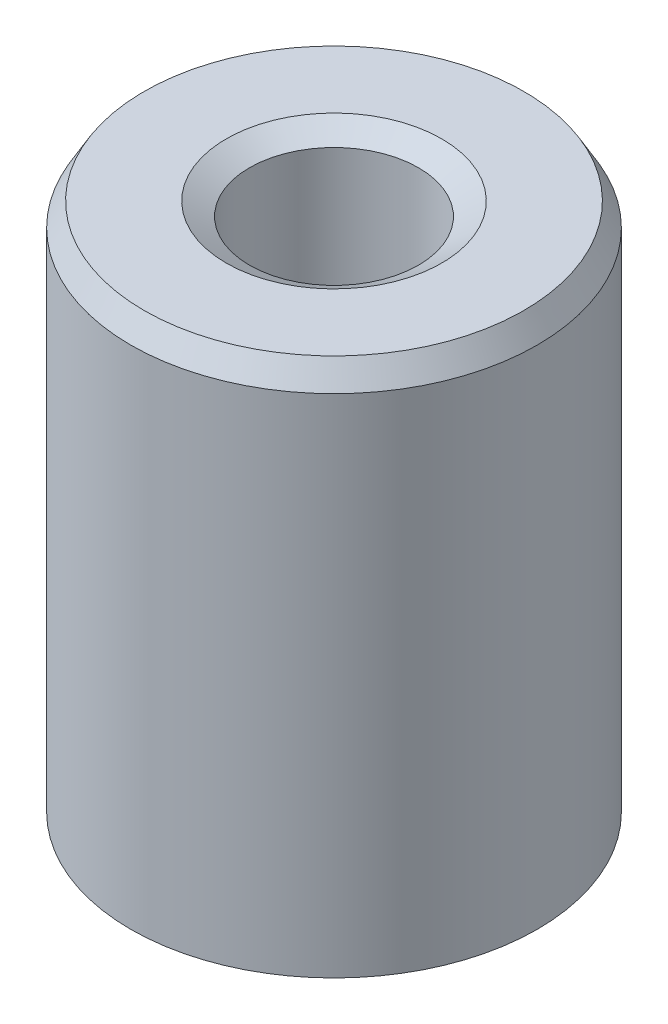
ISO-10303-21;
HEADER;
FILE_DESCRIPTION(('STEP AP214'),'2;1');
FILE_NAME('part.step','',(''),(''),'','','');
FILE_SCHEMA(('AUTOMOTIVE_DESIGN { 1 0 10303 214 1 1 1 1 }'));
ENDSEC;
DATA;
#1=APPLICATION_CONTEXT('core data for automotive mechanical design processes');
#2=APPLICATION_PROTOCOL_DEFINITION('international standard','automotive_design',2000,#1);
#3=PRODUCT_CONTEXT('',#1,'mechanical');
#4=PRODUCT('Part','Part','',(#3));
#5=PRODUCT_RELATED_PRODUCT_CATEGORY('part','',(#4));
#6=PRODUCT_DEFINITION_FORMATION('','',#4);
#7=PRODUCT_DEFINITION_CONTEXT('part definition',#1,'design');
#8=PRODUCT_DEFINITION('design','',#6,#7);
#9=PRODUCT_DEFINITION_SHAPE('','',#8);
#10=(LENGTH_UNIT() NAMED_UNIT(*) SI_UNIT(.MILLI.,.METRE.));
#11=(NAMED_UNIT(*) PLANE_ANGLE_UNIT() SI_UNIT($,.RADIAN.));
#12=(NAMED_UNIT(*) SI_UNIT($,.STERADIAN.) SOLID_ANGLE_UNIT());
#13=UNCERTAINTY_MEASURE_WITH_UNIT(LENGTH_MEASURE(1.E-05),#10,'distance_accuracy_value','');
#14=(GEOMETRIC_REPRESENTATION_CONTEXT(3) GLOBAL_UNCERTAINTY_ASSIGNED_CONTEXT((#13)) GLOBAL_UNIT_ASSIGNED_CONTEXT((#10,
#11,#12)) REPRESENTATION_CONTEXT('',''));
#15=CARTESIAN_POINT('',(0.,0.,0.));
#16=DIRECTION('',(0.,0.,1.));
#17=DIRECTION('',(1.,0.,0.));
#18=AXIS2_PLACEMENT_3D('',#15,#16,#17);
#19=CARTESIAN_POINT('',(0.,13.3513712068898,0.));
#20=DIRECTION('',(0.,-1.,0.));
#21=DIRECTION('',(0.,0.,-1.));
#22=AXIS2_PLACEMENT_3D('',#19,#20,#21);
#23=CYLINDRICAL_SURFACE('',#22,5.);
#24=CARTESIAN_POINT('',(0.,0.329792397933078,0.));
#25=DIRECTION('',(0.,1.,0.));
#26=DIRECTION('',(0.,0.,1.));
#27=AXIS2_PLACEMENT_3D('',#24,#25,#26);
#28=CIRCLE('',#27,5.);
#29=CARTESIAN_POINT('',(0.,0.329792397933078,5.));
#30=VERTEX_POINT('',#29);
#31=EDGE_CURVE('E10',#30,#30,#28,.T.);
#32=ORIENTED_EDGE('',*,*,#31,.T.);
#33=EDGE_LOOP('',(#32));
#34=FACE_BOUND('',#33,.T.);
#35=CARTESIAN_POINT('',(0.,12.7801540177198,0.));
#36=DIRECTION('',(0.,1.,0.));
#37=DIRECTION('',(0.,0.,1.));
#38=AXIS2_PLACEMENT_3D('',#35,#36,#37);
#39=CIRCLE('',#38,5.);
#40=CARTESIAN_POINT('',(0.,12.7801540177198,5.));
#41=VERTEX_POINT('',#40);
#42=EDGE_CURVE('E50',#41,#41,#39,.F.);
#43=ORIENTED_EDGE('',*,*,#42,.T.);
#44=EDGE_LOOP('',(#43));
#45=FACE_BOUND('',#44,.T.);
#46=ADVANCED_FACE('F39',(#34,#45),#23,.T.);
#47=CARTESIAN_POINT('',(0.,13.3513712068898,0.));
#48=DIRECTION('',(0.,1.,0.));
#49=DIRECTION('',(0.,0.,1.));
#50=AXIS2_PLACEMENT_3D('',#47,#48,#49);
#51=PLANE('',#50);
#52=CARTESIAN_POINT('',(0.,13.3513712068898,0.));
#53=DIRECTION('',(0.,1.,0.));
#54=DIRECTION('',(0.,0.,1.));
#55=AXIS2_PLACEMENT_3D('',#52,#53,#54);
#56=CIRCLE('',#55,2.65011560391063);
#57=CARTESIAN_POINT('',(0.,13.3513712068898,2.65011560391063));
#58=VERTEX_POINT('',#57);
#59=EDGE_CURVE('E58',#58,#58,#56,.F.);
#60=ORIENTED_EDGE('',*,*,#59,.T.);
#61=EDGE_LOOP('',(#60));
#62=FACE_BOUND('',#61,.T.);
#63=CARTESIAN_POINT('',(0.,13.3513712068898,0.));
#64=DIRECTION('',(0.,1.,0.));
#65=DIRECTION('',(0.,0.,1.));
#66=AXIS2_PLACEMENT_3D('',#63,#64,#65);
#67=CIRCLE('',#66,4.67020760206692);
#68=CARTESIAN_POINT('',(0.,13.3513712068898,4.67020760206692));
#69=VERTEX_POINT('',#68);
#70=EDGE_CURVE('E61',#69,#69,#67,.T.);
#71=ORIENTED_EDGE('',*,*,#70,.T.);
#72=EDGE_LOOP('',(#71));
#73=FACE_BOUND('',#72,.T.);
#74=ADVANCED_FACE('F88',(#62,#73),#51,.T.);
#75=CARTESIAN_POINT('',(0.,0.,0.));
#76=DIRECTION('',(0.,1.,0.));
#77=DIRECTION('',(0.,0.,1.));
#78=AXIS2_PLACEMENT_3D('',#75,#76,#77);
#79=PLANE('',#78);
#80=CARTESIAN_POINT('',(0.,0.,0.));
#81=DIRECTION('',(0.,1.,0.));
#82=DIRECTION('',(0.,0.,1.));
#83=AXIS2_PLACEMENT_3D('',#80,#81,#82);
#84=CIRCLE('',#83,2.40869081267364);
#85=CARTESIAN_POINT('',(0.,0.,2.40869081267364));
#86=VERTEX_POINT('',#85);
#87=EDGE_CURVE('E51',#86,#86,#84,.T.);
#88=ORIENTED_EDGE('',*,*,#87,.T.);
#89=EDGE_LOOP('',(#88));
#90=FACE_BOUND('',#89,.T.);
#91=CARTESIAN_POINT('',(0.,0.,0.));
#92=DIRECTION('',(0.,1.,0.));
#93=DIRECTION('',(0.,0.,1.));
#94=AXIS2_PLACEMENT_3D('',#91,#92,#93);
#95=CIRCLE('',#94,4.42878281082993);
#96=CARTESIAN_POINT('',(0.,0.,4.42878281082993));
#97=VERTEX_POINT('',#96);
#98=EDGE_CURVE('E54',#97,#97,#95,.F.);
#99=ORIENTED_EDGE('',*,*,#98,.T.);
#100=EDGE_LOOP('',(#99));
#101=FACE_BOUND('',#100,.T.);
#102=ADVANCED_FACE('F83',(#90,#101),#79,.F.);
#103=CARTESIAN_POINT('',(0.,13.3513712068898,0.));
#104=DIRECTION('',(0.,-1.,0.));
#105=DIRECTION('',(0.,0.,-1.));
#106=AXIS2_PLACEMENT_3D('',#103,#104,#105);
#107=CYLINDRICAL_SURFACE('',#106,2.07889841474056);
#108=CARTESIAN_POINT('',(0.,13.0215788089568,0.));
#109=DIRECTION('',(0.,1.,0.));
#110=DIRECTION('',(0.,0.,1.));
#111=AXIS2_PLACEMENT_3D('',#108,#109,#110);
#112=CIRCLE('',#111,2.07889841474056);
#113=CARTESIAN_POINT('',(0.,13.0215788089568,2.07889841474056));
#114=VERTEX_POINT('',#113);
#115=EDGE_CURVE('E67',#114,#114,#112,.T.);
#116=ORIENTED_EDGE('',*,*,#115,.T.);
#117=EDGE_LOOP('',(#116));
#118=FACE_BOUND('',#117,.T.);
#119=CARTESIAN_POINT('',(0.,0.571217189170073,0.));
#120=DIRECTION('',(0.,1.,0.));
#121=DIRECTION('',(0.,0.,1.));
#122=AXIS2_PLACEMENT_3D('',#119,#120,#121);
#123=CIRCLE('',#122,2.07889841474056);
#124=CARTESIAN_POINT('',(0.,0.571217189170073,2.07889841474056));
#125=VERTEX_POINT('',#124);
#126=EDGE_CURVE('E69',#125,#125,#123,.F.);
#127=ORIENTED_EDGE('',*,*,#126,.T.);
#128=EDGE_LOOP('',(#127));
#129=FACE_BOUND('',#128,.T.);
#130=ADVANCED_FACE('F71',(#118,#129),#107,.F.);
#131=CARTESIAN_POINT('',(0.,13.0215788089568,0.));
#132=DIRECTION('',(0.,1.,0.));
#133=DIRECTION('',(0.,0.,1.));
#134=AXIS2_PLACEMENT_3D('',#131,#132,#133);
#135=CONICAL_SURFACE('',#134,2.07889841474056,1.0471975511966);
#136=ORIENTED_EDGE('',*,*,#59,.F.);
#137=EDGE_LOOP('',(#136));
#138=FACE_BOUND('',#137,.T.);
#139=ORIENTED_EDGE('',*,*,#115,.F.);
#140=EDGE_LOOP('',(#139));
#141=FACE_BOUND('',#140,.T.);
#142=ADVANCED_FACE('F77',(#138,#141),#135,.F.);
#143=CARTESIAN_POINT('',(0.,0.,0.));
#144=DIRECTION('',(0.,-1.,0.));
#145=DIRECTION('',(0.,0.,-1.));
#146=AXIS2_PLACEMENT_3D('',#143,#144,#145);
#147=CONICAL_SURFACE('',#146,2.40869081267364,0.523598775598294);
#148=ORIENTED_EDGE('',*,*,#126,.F.);
#149=EDGE_LOOP('',(#148));
#150=FACE_BOUND('',#149,.T.);
#151=ORIENTED_EDGE('',*,*,#87,.F.);
#152=EDGE_LOOP('',(#151));
#153=FACE_BOUND('',#152,.T.);
#154=ADVANCED_FACE('F73',(#150,#153),#147,.F.);
#155=CARTESIAN_POINT('',(0.,0.329792397933078,0.));
#156=DIRECTION('',(0.,1.,0.));
#157=DIRECTION('',(0.,0.,1.));
#158=AXIS2_PLACEMENT_3D('',#155,#156,#157);
#159=CONICAL_SURFACE('',#158,5.,1.0471975511966);
#160=ORIENTED_EDGE('',*,*,#98,.F.);
#161=EDGE_LOOP('',(#160));
#162=FACE_BOUND('',#161,.T.);
#163=ORIENTED_EDGE('',*,*,#31,.F.);
#164=EDGE_LOOP('',(#163));
#165=FACE_BOUND('',#164,.T.);
#166=ADVANCED_FACE('F76',(#162,#165),#159,.T.);
#167=CARTESIAN_POINT('',(0.,13.3513712068898,0.));
#168=DIRECTION('',(0.,-1.,0.));
#169=DIRECTION('',(0.,0.,-1.));
#170=AXIS2_PLACEMENT_3D('',#167,#168,#169);
#171=CONICAL_SURFACE('',#170,4.67020760206692,0.523598775598295);
#172=ORIENTED_EDGE('',*,*,#42,.F.);
#173=EDGE_LOOP('',(#172));
#174=FACE_BOUND('',#173,.T.);
#175=ORIENTED_EDGE('',*,*,#70,.F.);
#176=EDGE_LOOP('',(#175));
#177=FACE_BOUND('',#176,.T.);
#178=ADVANCED_FACE('F45',(#174,#177),#171,.T.);
#179=CLOSED_SHELL('',(#46,#74,#102,#130,#142,#154,#166,#178));
#180=MANIFOLD_SOLID_BREP('B2',#179);
#181=ADVANCED_BREP_SHAPE_REPRESENTATION('',(#18,#180),#14);
#182=SHAPE_DEFINITION_REPRESENTATION(#9,#181);
ENDSEC;
END-ISO-10303-21;
